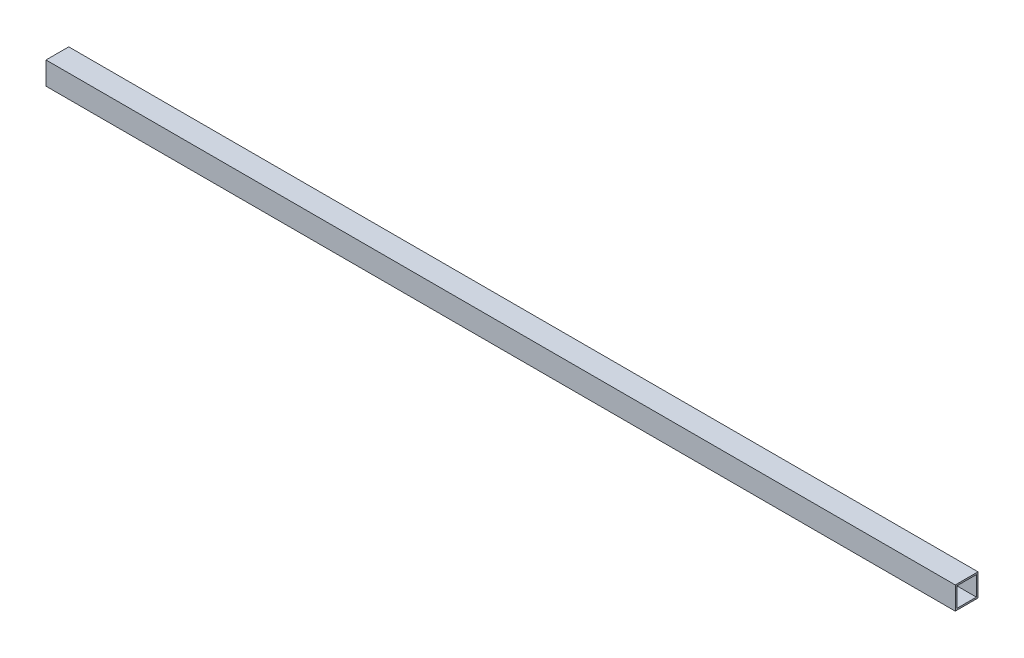
ISO-10303-21;
HEADER;
FILE_DESCRIPTION(('STEP AP214'),'2;1');
FILE_NAME('part.step','',(''),(''),'','','');
FILE_SCHEMA(('AUTOMOTIVE_DESIGN { 1 0 10303 214 1 1 1 1 }'));
ENDSEC;
DATA;
#1=APPLICATION_CONTEXT('core data for automotive mechanical design processes');
#2=APPLICATION_PROTOCOL_DEFINITION('international standard','automotive_design',2000,#1);
#3=PRODUCT_CONTEXT('',#1,'mechanical');
#4=PRODUCT('Part','Part','',(#3));
#5=PRODUCT_RELATED_PRODUCT_CATEGORY('part','',(#4));
#6=PRODUCT_DEFINITION_FORMATION('','',#4);
#7=PRODUCT_DEFINITION_CONTEXT('part definition',#1,'design');
#8=PRODUCT_DEFINITION('design','',#6,#7);
#9=PRODUCT_DEFINITION_SHAPE('','',#8);
#10=(LENGTH_UNIT() NAMED_UNIT(*) SI_UNIT(.MILLI.,.METRE.));
#11=(NAMED_UNIT(*) PLANE_ANGLE_UNIT() SI_UNIT($,.RADIAN.));
#12=(NAMED_UNIT(*) SI_UNIT($,.STERADIAN.) SOLID_ANGLE_UNIT());
#13=UNCERTAINTY_MEASURE_WITH_UNIT(LENGTH_MEASURE(1.E-05),#10,'distance_accuracy_value','');
#14=(GEOMETRIC_REPRESENTATION_CONTEXT(3) GLOBAL_UNCERTAINTY_ASSIGNED_CONTEXT((#13)) GLOBAL_UNIT_ASSIGNED_CONTEXT((#10,
#11,#12)) REPRESENTATION_CONTEXT('',''));
#15=CARTESIAN_POINT('',(0.,0.,0.));
#16=DIRECTION('',(0.,0.,1.));
#17=DIRECTION('',(1.,0.,0.));
#18=AXIS2_PLACEMENT_3D('',#15,#16,#17);
#19=CARTESIAN_POINT('',(889.,-22.225,22.225));
#20=DIRECTION('',(0.,-1.,0.));
#21=DIRECTION('',(0.,0.,-1.));
#22=AXIS2_PLACEMENT_3D('',#19,#20,#21);
#23=PLANE('',#22);
#24=DIRECTION('',(-1.,0.,0.));
#25=VECTOR('',#24,1.);
#26=CARTESIAN_POINT('',(889.,-22.225,-22.225));
#27=LINE('',#26,#25);
#28=CARTESIAN_POINT('',(889.,-22.225,-22.225));
#29=VERTEX_POINT('',#28);
#30=CARTESIAN_POINT('',(-889.,-22.225,-22.225));
#31=VERTEX_POINT('',#30);
#32=EDGE_CURVE('E88',#29,#31,#27,.T.);
#33=ORIENTED_EDGE('',*,*,#32,.F.);
#34=DIRECTION('',(0.,0.,-1.));
#35=VECTOR('',#34,1.);
#36=CARTESIAN_POINT('',(889.,-22.225,0.));
#37=LINE('',#36,#35);
#38=CARTESIAN_POINT('',(889.,-22.225,22.225));
#39=VERTEX_POINT('',#38);
#40=EDGE_CURVE('E133',#39,#29,#37,.T.);
#41=ORIENTED_EDGE('',*,*,#40,.F.);
#42=DIRECTION('',(1.,0.,0.));
#43=VECTOR('',#42,1.);
#44=CARTESIAN_POINT('',(889.,-22.225,22.225));
#45=LINE('',#44,#43);
#46=CARTESIAN_POINT('',(-889.,-22.225,22.225));
#47=VERTEX_POINT('',#46);
#48=EDGE_CURVE('E140',#47,#39,#45,.T.);
#49=ORIENTED_EDGE('',*,*,#48,.F.);
#50=DIRECTION('',(0.,0.,-1.));
#51=VECTOR('',#50,1.);
#52=CARTESIAN_POINT('',(-889.,-22.225,0.));
#53=LINE('',#52,#51);
#54=EDGE_CURVE('E109',#47,#31,#53,.T.);
#55=ORIENTED_EDGE('',*,*,#54,.T.);
#56=EDGE_LOOP('',(#33,#41,#49,#55));
#57=FACE_BOUND('',#56,.T.);
#58=ADVANCED_FACE('F16',(#57),#23,.T.);
#59=CARTESIAN_POINT('',(889.,-19.05,-19.05));
#60=DIRECTION('',(0.,1.,0.));
#61=DIRECTION('',(0.,0.,1.));
#62=AXIS2_PLACEMENT_3D('',#59,#60,#61);
#63=PLANE('',#62);
#64=DIRECTION('',(-1.,0.,0.));
#65=VECTOR('',#64,1.);
#66=CARTESIAN_POINT('',(889.,-19.05,19.05));
#67=LINE('',#66,#65);
#68=CARTESIAN_POINT('',(889.,-19.05,19.05));
#69=VERTEX_POINT('',#68);
#70=CARTESIAN_POINT('',(-889.,-19.05,19.05));
#71=VERTEX_POINT('',#70);
#72=EDGE_CURVE('E19',#69,#71,#67,.T.);
#73=ORIENTED_EDGE('',*,*,#72,.F.);
#74=DIRECTION('',(0.,0.,-1.));
#75=VECTOR('',#74,1.);
#76=CARTESIAN_POINT('',(889.,-19.05,0.));
#77=LINE('',#76,#75);
#78=CARTESIAN_POINT('',(889.,-19.05,-19.05));
#79=VERTEX_POINT('',#78);
#80=EDGE_CURVE('E84',#79,#69,#77,.F.);
#81=ORIENTED_EDGE('',*,*,#80,.F.);
#82=DIRECTION('',(1.,0.,0.));
#83=VECTOR('',#82,1.);
#84=CARTESIAN_POINT('',(889.,-19.05,-19.05));
#85=LINE('',#84,#83);
#86=CARTESIAN_POINT('',(-889.,-19.05,-19.05));
#87=VERTEX_POINT('',#86);
#88=EDGE_CURVE('E77',#87,#79,#85,.T.);
#89=ORIENTED_EDGE('',*,*,#88,.F.);
#90=DIRECTION('',(0.,0.,-1.));
#91=VECTOR('',#90,1.);
#92=CARTESIAN_POINT('',(-889.,-19.05,0.));
#93=LINE('',#92,#91);
#94=EDGE_CURVE('E81',#87,#71,#93,.F.);
#95=ORIENTED_EDGE('',*,*,#94,.T.);
#96=EDGE_LOOP('',(#73,#81,#89,#95));
#97=FACE_BOUND('',#96,.T.);
#98=ADVANCED_FACE('F79',(#97),#63,.T.);
#99=CARTESIAN_POINT('',(889.,-19.05,19.05));
#100=DIRECTION('',(0.,0.,-1.));
#101=DIRECTION('',(-1.,0.,0.));
#102=AXIS2_PLACEMENT_3D('',#99,#100,#101);
#103=PLANE('',#102);
#104=DIRECTION('',(1.,0.,0.));
#105=VECTOR('',#104,1.);
#106=CARTESIAN_POINT('',(889.,19.05,19.05));
#107=LINE('',#106,#105);
#108=CARTESIAN_POINT('',(889.,19.05,19.05));
#109=VERTEX_POINT('',#108);
#110=CARTESIAN_POINT('',(-889.,19.05,19.05));
#111=VERTEX_POINT('',#110);
#112=EDGE_CURVE('E114',#109,#111,#107,.F.);
#113=ORIENTED_EDGE('',*,*,#112,.F.);
#114=DIRECTION('',(0.,1.,0.));
#115=VECTOR('',#114,1.);
#116=CARTESIAN_POINT('',(889.,0.,19.05));
#117=LINE('',#116,#115);
#118=EDGE_CURVE('E122',#69,#109,#117,.T.);
#119=ORIENTED_EDGE('',*,*,#118,.F.);
#120=ORIENTED_EDGE('',*,*,#72,.T.);
#121=DIRECTION('',(0.,1.,0.));
#122=VECTOR('',#121,1.);
#123=CARTESIAN_POINT('',(-889.,0.,19.05));
#124=LINE('',#123,#122);
#125=EDGE_CURVE('E102',#71,#111,#124,.T.);
#126=ORIENTED_EDGE('',*,*,#125,.T.);
#127=EDGE_LOOP('',(#113,#119,#120,#126));
#128=FACE_BOUND('',#127,.T.);
#129=ADVANCED_FACE('F120',(#128),#103,.T.);
#130=CARTESIAN_POINT('',(889.,19.05,19.05));
#131=DIRECTION('',(0.,-1.,0.));
#132=DIRECTION('',(0.,0.,-1.));
#133=AXIS2_PLACEMENT_3D('',#130,#131,#132);
#134=PLANE('',#133);
#135=DIRECTION('',(1.,0.,0.));
#136=VECTOR('',#135,1.);
#137=CARTESIAN_POINT('',(889.,19.05,-19.05));
#138=LINE('',#137,#136);
#139=CARTESIAN_POINT('',(889.,19.05,-19.05));
#140=VERTEX_POINT('',#139);
#141=CARTESIAN_POINT('',(-889.,19.05,-19.05));
#142=VERTEX_POINT('',#141);
#143=EDGE_CURVE('E89',#140,#142,#138,.F.);
#144=ORIENTED_EDGE('',*,*,#143,.F.);
#145=DIRECTION('',(0.,0.,-1.));
#146=VECTOR('',#145,1.);
#147=CARTESIAN_POINT('',(889.,19.05,0.));
#148=LINE('',#147,#146);
#149=EDGE_CURVE('E125',#109,#140,#148,.T.);
#150=ORIENTED_EDGE('',*,*,#149,.F.);
#151=ORIENTED_EDGE('',*,*,#112,.T.);
#152=DIRECTION('',(0.,0.,-1.));
#153=VECTOR('',#152,1.);
#154=CARTESIAN_POINT('',(-889.,19.05,0.));
#155=LINE('',#154,#153);
#156=EDGE_CURVE('E104',#111,#142,#155,.T.);
#157=ORIENTED_EDGE('',*,*,#156,.T.);
#158=EDGE_LOOP('',(#144,#150,#151,#157));
#159=FACE_BOUND('',#158,.T.);
#160=ADVANCED_FACE('F144',(#159),#134,.T.);
#161=CARTESIAN_POINT('',(889.,19.05,-19.05));
#162=DIRECTION('',(0.,0.,1.));
#163=DIRECTION('',(1.,0.,0.));
#164=AXIS2_PLACEMENT_3D('',#161,#162,#163);
#165=PLANE('',#164);
#166=ORIENTED_EDGE('',*,*,#88,.T.);
#167=DIRECTION('',(0.,1.,0.));
#168=VECTOR('',#167,1.);
#169=CARTESIAN_POINT('',(889.,0.,-19.05));
#170=LINE('',#169,#168);
#171=EDGE_CURVE('E129',#140,#79,#170,.F.);
#172=ORIENTED_EDGE('',*,*,#171,.F.);
#173=ORIENTED_EDGE('',*,*,#143,.T.);
#174=DIRECTION('',(0.,1.,0.));
#175=VECTOR('',#174,1.);
#176=CARTESIAN_POINT('',(-889.,0.,-19.05));
#177=LINE('',#176,#175);
#178=EDGE_CURVE('E92',#142,#87,#177,.F.);
#179=ORIENTED_EDGE('',*,*,#178,.T.);
#180=EDGE_LOOP('',(#166,#172,#173,#179));
#181=FACE_BOUND('',#180,.T.);
#182=ADVANCED_FACE('F93',(#181),#165,.T.);
#183=CARTESIAN_POINT('',(889.,-22.225,-22.225));
#184=DIRECTION('',(0.,0.,-1.));
#185=DIRECTION('',(-1.,0.,0.));
#186=AXIS2_PLACEMENT_3D('',#183,#184,#185);
#187=PLANE('',#186);
#188=DIRECTION('',(1.,0.,0.));
#189=VECTOR('',#188,1.);
#190=CARTESIAN_POINT('',(889.,22.225,-22.225));
#191=LINE('',#190,#189);
#192=CARTESIAN_POINT('',(889.,22.225,-22.225));
#193=VERTEX_POINT('',#192);
#194=CARTESIAN_POINT('',(-889.,22.225,-22.225));
#195=VERTEX_POINT('',#194);
#196=EDGE_CURVE('E145',#193,#195,#191,.F.);
#197=ORIENTED_EDGE('',*,*,#196,.F.);
#198=DIRECTION('',(0.,1.,0.));
#199=VECTOR('',#198,1.);
#200=CARTESIAN_POINT('',(889.,0.,-22.225));
#201=LINE('',#200,#199);
#202=EDGE_CURVE('E130',#29,#193,#201,.T.);
#203=ORIENTED_EDGE('',*,*,#202,.F.);
#204=ORIENTED_EDGE('',*,*,#32,.T.);
#205=DIRECTION('',(0.,1.,0.));
#206=VECTOR('',#205,1.);
#207=CARTESIAN_POINT('',(-889.,0.,-22.225));
#208=LINE('',#207,#206);
#209=EDGE_CURVE('E97',#31,#195,#208,.T.);
#210=ORIENTED_EDGE('',*,*,#209,.T.);
#211=EDGE_LOOP('',(#197,#203,#204,#210));
#212=FACE_BOUND('',#211,.T.);
#213=ADVANCED_FACE('F164',(#212),#187,.T.);
#214=CARTESIAN_POINT('',(-889.,0.,0.));
#215=DIRECTION('',(1.,0.,0.));
#216=DIRECTION('',(0.,0.,-1.));
#217=AXIS2_PLACEMENT_3D('',#214,#215,#216);
#218=PLANE('',#217);
#219=ORIENTED_EDGE('',*,*,#125,.F.);
#220=ORIENTED_EDGE('',*,*,#94,.F.);
#221=ORIENTED_EDGE('',*,*,#178,.F.);
#222=ORIENTED_EDGE('',*,*,#156,.F.);
#223=EDGE_LOOP('',(#219,#220,#221,#222));
#224=FACE_BOUND('',#223,.T.);
#225=ORIENTED_EDGE('',*,*,#54,.F.);
#226=DIRECTION('',(0.,1.,0.));
#227=VECTOR('',#226,1.);
#228=CARTESIAN_POINT('',(-889.,22.225,22.225));
#229=LINE('',#228,#227);
#230=CARTESIAN_POINT('',(-889.,22.225,22.225));
#231=VERTEX_POINT('',#230);
#232=EDGE_CURVE('E142',#231,#47,#229,.F.);
#233=ORIENTED_EDGE('',*,*,#232,.F.);
#234=DIRECTION('',(0.,0.,1.));
#235=VECTOR('',#234,1.);
#236=CARTESIAN_POINT('',(-889.,22.225,-22.225));
#237=LINE('',#236,#235);
#238=EDGE_CURVE('E150',#195,#231,#237,.T.);
#239=ORIENTED_EDGE('',*,*,#238,.F.);
#240=ORIENTED_EDGE('',*,*,#209,.F.);
#241=EDGE_LOOP('',(#225,#233,#239,#240));
#242=FACE_BOUND('',#241,.T.);
#243=ADVANCED_FACE('F100',(#224,#242),#218,.F.);
#244=CARTESIAN_POINT('',(889.,22.225,22.225));
#245=DIRECTION('',(0.,0.,1.));
#246=DIRECTION('',(1.,0.,0.));
#247=AXIS2_PLACEMENT_3D('',#244,#245,#246);
#248=PLANE('',#247);
#249=ORIENTED_EDGE('',*,*,#48,.T.);
#250=DIRECTION('',(0.,1.,0.));
#251=VECTOR('',#250,1.);
#252=CARTESIAN_POINT('',(889.,0.,22.225));
#253=LINE('',#252,#251);
#254=CARTESIAN_POINT('',(889.,22.225,22.225));
#255=VERTEX_POINT('',#254);
#256=EDGE_CURVE('E34',#255,#39,#253,.F.);
#257=ORIENTED_EDGE('',*,*,#256,.F.);
#258=DIRECTION('',(1.,0.,0.));
#259=VECTOR('',#258,1.);
#260=CARTESIAN_POINT('',(889.,22.225,22.225));
#261=LINE('',#260,#259);
#262=EDGE_CURVE('E25',#231,#255,#261,.T.);
#263=ORIENTED_EDGE('',*,*,#262,.F.);
#264=ORIENTED_EDGE('',*,*,#232,.T.);
#265=EDGE_LOOP('',(#249,#257,#263,#264));
#266=FACE_BOUND('',#265,.T.);
#267=ADVANCED_FACE('F157',(#266),#248,.T.);
#268=CARTESIAN_POINT('',(889.,0.,0.));
#269=DIRECTION('',(1.,0.,0.));
#270=DIRECTION('',(0.,0.,-1.));
#271=AXIS2_PLACEMENT_3D('',#268,#269,#270);
#272=PLANE('',#271);
#273=ORIENTED_EDGE('',*,*,#149,.T.);
#274=ORIENTED_EDGE('',*,*,#171,.T.);
#275=ORIENTED_EDGE('',*,*,#80,.T.);
#276=ORIENTED_EDGE('',*,*,#118,.T.);
#277=EDGE_LOOP('',(#273,#274,#275,#276));
#278=FACE_BOUND('',#277,.T.);
#279=ORIENTED_EDGE('',*,*,#202,.T.);
#280=DIRECTION('',(0.,0.,1.));
#281=VECTOR('',#280,1.);
#282=CARTESIAN_POINT('',(889.,22.225,-22.225));
#283=LINE('',#282,#281);
#284=EDGE_CURVE('E11',#255,#193,#283,.F.);
#285=ORIENTED_EDGE('',*,*,#284,.F.);
#286=ORIENTED_EDGE('',*,*,#256,.T.);
#287=ORIENTED_EDGE('',*,*,#40,.T.);
#288=EDGE_LOOP('',(#279,#285,#286,#287));
#289=FACE_BOUND('',#288,.T.);
#290=ADVANCED_FACE('F127',(#278,#289),#272,.T.);
#291=CARTESIAN_POINT('',(889.,22.225,-22.225));
#292=DIRECTION('',(0.,1.,0.));
#293=DIRECTION('',(0.,0.,1.));
#294=AXIS2_PLACEMENT_3D('',#291,#292,#293);
#295=PLANE('',#294);
#296=ORIENTED_EDGE('',*,*,#262,.T.);
#297=ORIENTED_EDGE('',*,*,#284,.T.);
#298=ORIENTED_EDGE('',*,*,#196,.T.);
#299=ORIENTED_EDGE('',*,*,#238,.T.);
#300=EDGE_LOOP('',(#296,#297,#298,#299));
#301=FACE_BOUND('',#300,.T.);
#302=ADVANCED_FACE('F155',(#301),#295,.T.);
#303=CLOSED_SHELL('',(#58,#98,#129,#160,#182,#213,#243,#267,#290,#302));
#304=MANIFOLD_SOLID_BREP('B1',#303);
#305=ADVANCED_BREP_SHAPE_REPRESENTATION('',(#18,#304),#14);
#306=SHAPE_DEFINITION_REPRESENTATION(#9,#305);
ENDSEC;
END-ISO-10303-21;
